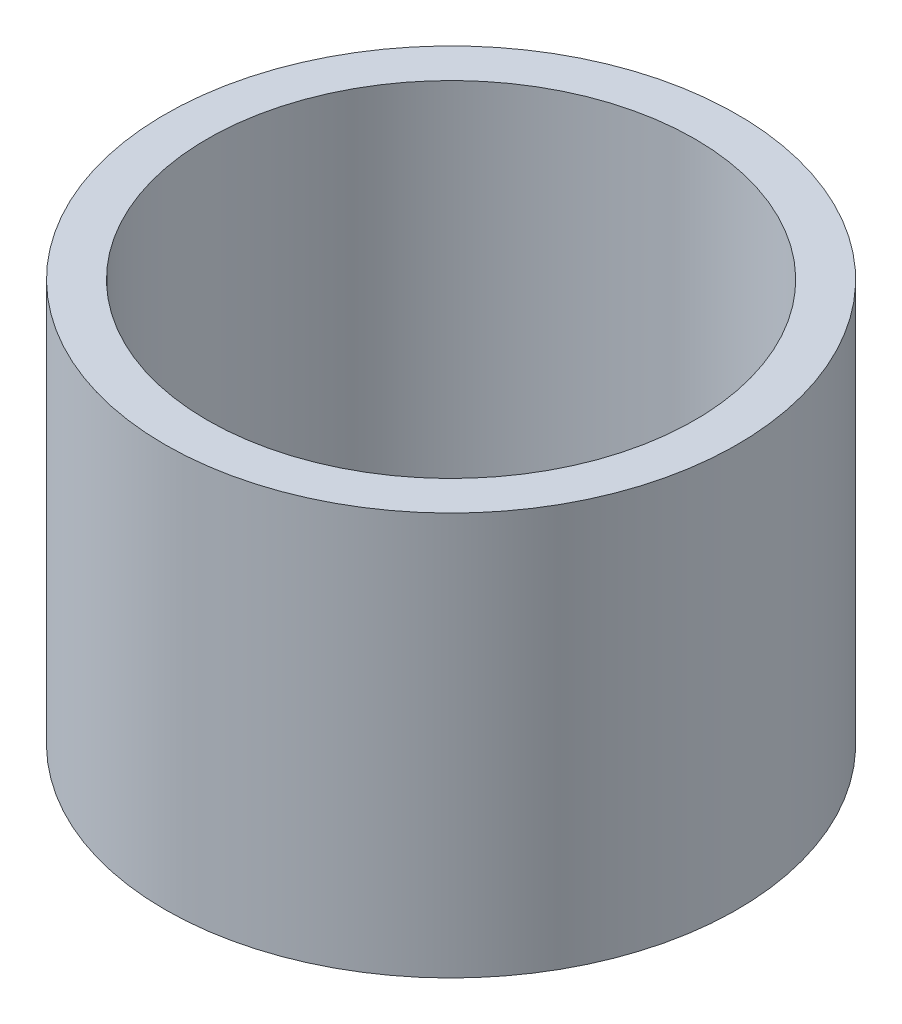
ISO-10303-21;
HEADER;
FILE_DESCRIPTION(('STEP AP214'),'2;1');
FILE_NAME('part.step','',(''),(''),'','','');
FILE_SCHEMA(('AUTOMOTIVE_DESIGN { 1 0 10303 214 1 1 1 1 }'));
ENDSEC;
DATA;
#1=APPLICATION_CONTEXT('core data for automotive mechanical design processes');
#2=APPLICATION_PROTOCOL_DEFINITION('international standard','automotive_design',2000,#1);
#3=PRODUCT_CONTEXT('',#1,'mechanical');
#4=PRODUCT('Part','Part','',(#3));
#5=PRODUCT_RELATED_PRODUCT_CATEGORY('part','',(#4));
#6=PRODUCT_DEFINITION_FORMATION('','',#4);
#7=PRODUCT_DEFINITION_CONTEXT('part definition',#1,'design');
#8=PRODUCT_DEFINITION('design','',#6,#7);
#9=PRODUCT_DEFINITION_SHAPE('','',#8);
#10=(LENGTH_UNIT() NAMED_UNIT(*) SI_UNIT(.MILLI.,.METRE.));
#11=(NAMED_UNIT(*) PLANE_ANGLE_UNIT() SI_UNIT($,.RADIAN.));
#12=(NAMED_UNIT(*) SI_UNIT($,.STERADIAN.) SOLID_ANGLE_UNIT());
#13=UNCERTAINTY_MEASURE_WITH_UNIT(LENGTH_MEASURE(1.E-05),#10,'distance_accuracy_value','');
#14=(GEOMETRIC_REPRESENTATION_CONTEXT(3) GLOBAL_UNCERTAINTY_ASSIGNED_CONTEXT((#13)) GLOBAL_UNIT_ASSIGNED_CONTEXT((#10,
#11,#12)) REPRESENTATION_CONTEXT('',''));
#15=CARTESIAN_POINT('',(0.,0.,0.));
#16=DIRECTION('',(0.,0.,1.));
#17=DIRECTION('',(1.,0.,0.));
#18=AXIS2_PLACEMENT_3D('',#15,#16,#17);
#19=CARTESIAN_POINT('',(0.,1.9,0.));
#20=DIRECTION('',(0.,-1.,0.));
#21=DIRECTION('',(0.,0.,-1.));
#22=AXIS2_PLACEMENT_3D('',#19,#20,#21);
#23=CYLINDRICAL_SURFACE('',#22,1.35);
#24=CARTESIAN_POINT('',(0.,1.9,0.));
#25=DIRECTION('',(0.,1.,0.));
#26=DIRECTION('',(0.,0.,1.));
#27=AXIS2_PLACEMENT_3D('',#24,#25,#26);
#28=CIRCLE('',#27,1.35);
#29=CARTESIAN_POINT('',(0.,1.9,1.35));
#30=VERTEX_POINT('',#29);
#31=EDGE_CURVE('E12',#30,#30,#28,.T.);
#32=ORIENTED_EDGE('',*,*,#31,.F.);
#33=EDGE_LOOP('',(#32));
#34=FACE_BOUND('',#33,.T.);
#35=CARTESIAN_POINT('',(0.,0.,0.));
#36=DIRECTION('',(0.,1.,0.));
#37=DIRECTION('',(0.,0.,1.));
#38=AXIS2_PLACEMENT_3D('',#35,#36,#37);
#39=CIRCLE('',#38,1.35);
#40=CARTESIAN_POINT('',(0.,0.,1.35));
#41=VERTEX_POINT('',#40);
#42=EDGE_CURVE('E49',#41,#41,#39,.T.);
#43=ORIENTED_EDGE('',*,*,#42,.T.);
#44=EDGE_LOOP('',(#43));
#45=FACE_BOUND('',#44,.T.);
#46=ADVANCED_FACE('F46',(#34,#45),#23,.T.);
#47=CARTESIAN_POINT('',(0.,1.9,0.));
#48=DIRECTION('',(0.,1.,0.));
#49=DIRECTION('',(0.,0.,1.));
#50=AXIS2_PLACEMENT_3D('',#47,#48,#49);
#51=PLANE('',#50);
#52=CARTESIAN_POINT('',(0.,1.9,0.));
#53=DIRECTION('',(0.,1.,0.));
#54=DIRECTION('',(0.,0.,1.));
#55=AXIS2_PLACEMENT_3D('',#52,#53,#54);
#56=CIRCLE('',#55,1.15);
#57=CARTESIAN_POINT('',(0.,1.9,1.15));
#58=VERTEX_POINT('',#57);
#59=EDGE_CURVE('E58',#58,#58,#56,.T.);
#60=ORIENTED_EDGE('',*,*,#59,.F.);
#61=EDGE_LOOP('',(#60));
#62=FACE_BOUND('',#61,.T.);
#63=ORIENTED_EDGE('',*,*,#31,.T.);
#64=EDGE_LOOP('',(#63));
#65=FACE_BOUND('',#64,.T.);
#66=ADVANCED_FACE('F73',(#62,#65),#51,.T.);
#67=CARTESIAN_POINT('',(0.,0.,0.));
#68=DIRECTION('',(0.,1.,0.));
#69=DIRECTION('',(0.,0.,1.));
#70=AXIS2_PLACEMENT_3D('',#67,#68,#69);
#71=PLANE('',#70);
#72=CARTESIAN_POINT('',(0.,0.,0.));
#73=DIRECTION('',(0.,1.,0.));
#74=DIRECTION('',(0.,0.,1.));
#75=AXIS2_PLACEMENT_3D('',#72,#73,#74);
#76=CIRCLE('',#75,1.15);
#77=CARTESIAN_POINT('',(0.,0.,1.15));
#78=VERTEX_POINT('',#77);
#79=EDGE_CURVE('E56',#78,#78,#76,.T.);
#80=ORIENTED_EDGE('',*,*,#79,.T.);
#81=EDGE_LOOP('',(#80));
#82=FACE_BOUND('',#81,.T.);
#83=ORIENTED_EDGE('',*,*,#42,.F.);
#84=EDGE_LOOP('',(#83));
#85=FACE_BOUND('',#84,.T.);
#86=ADVANCED_FACE('F64',(#82,#85),#71,.F.);
#87=CARTESIAN_POINT('',(0.,0.,0.));
#88=DIRECTION('',(0.,1.,0.));
#89=DIRECTION('',(0.,0.,1.));
#90=AXIS2_PLACEMENT_3D('',#87,#88,#89);
#91=CYLINDRICAL_SURFACE('',#90,1.15);
#92=ORIENTED_EDGE('',*,*,#79,.F.);
#93=EDGE_LOOP('',(#92));
#94=FACE_BOUND('',#93,.T.);
#95=ORIENTED_EDGE('',*,*,#59,.T.);
#96=EDGE_LOOP('',(#95));
#97=FACE_BOUND('',#96,.T.);
#98=ADVANCED_FACE('F67',(#94,#97),#91,.F.);
#99=CLOSED_SHELL('',(#46,#66,#86,#98));
#100=MANIFOLD_SOLID_BREP('B2',#99);
#101=ADVANCED_BREP_SHAPE_REPRESENTATION('',(#18,#100),#14);
#102=SHAPE_DEFINITION_REPRESENTATION(#9,#101);
ENDSEC;
END-ISO-10303-21;
